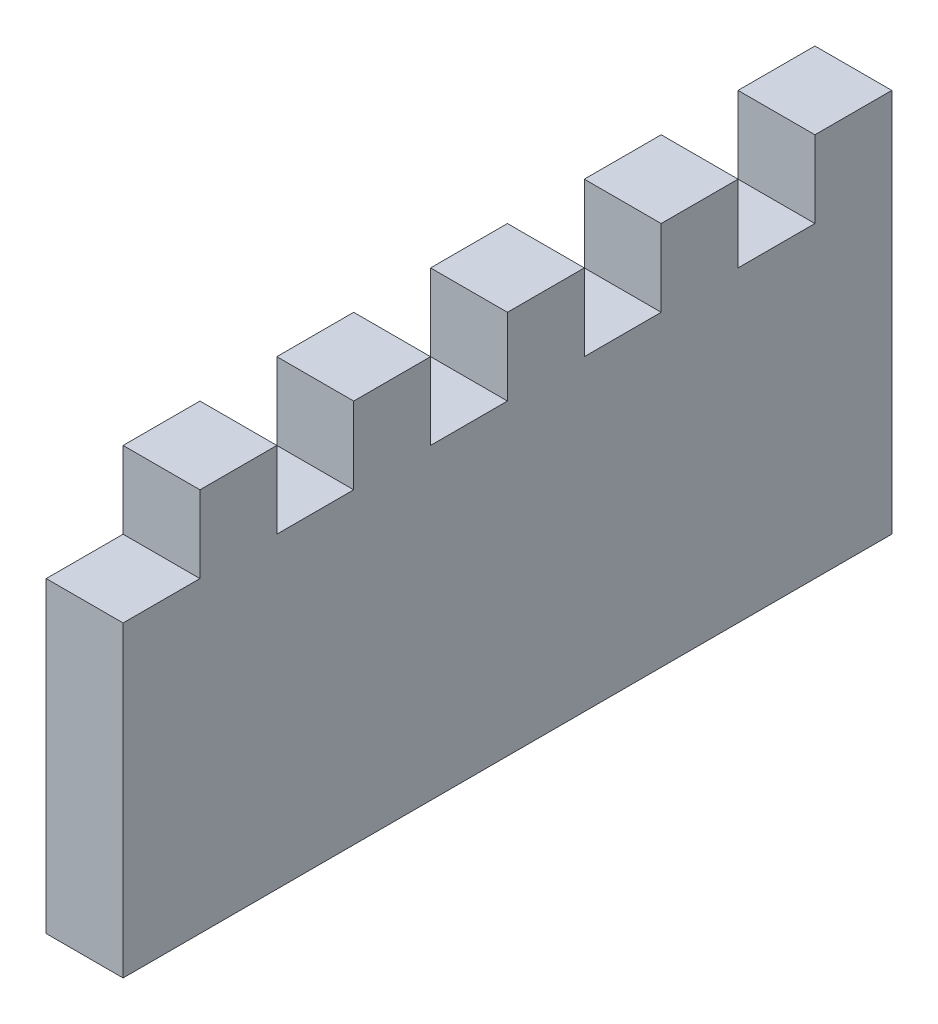
ISO-10303-21;
HEADER;
FILE_DESCRIPTION(('STEP AP214'),'2;1');
FILE_NAME('part.step','',(''),(''),'','','');
FILE_SCHEMA(('AUTOMOTIVE_DESIGN { 1 0 10303 214 1 1 1 1 }'));
ENDSEC;
DATA;
#1=APPLICATION_CONTEXT('core data for automotive mechanical design processes');
#2=APPLICATION_PROTOCOL_DEFINITION('international standard','automotive_design',2000,#1);
#3=PRODUCT_CONTEXT('',#1,'mechanical');
#4=PRODUCT('Part','Part','',(#3));
#5=PRODUCT_RELATED_PRODUCT_CATEGORY('part','',(#4));
#6=PRODUCT_DEFINITION_FORMATION('','',#4);
#7=PRODUCT_DEFINITION_CONTEXT('part definition',#1,'design');
#8=PRODUCT_DEFINITION('design','',#6,#7);
#9=PRODUCT_DEFINITION_SHAPE('','',#8);
#10=(LENGTH_UNIT() NAMED_UNIT(*) SI_UNIT(.MILLI.,.METRE.));
#11=(NAMED_UNIT(*) PLANE_ANGLE_UNIT() SI_UNIT($,.RADIAN.));
#12=(NAMED_UNIT(*) SI_UNIT($,.STERADIAN.) SOLID_ANGLE_UNIT());
#13=UNCERTAINTY_MEASURE_WITH_UNIT(LENGTH_MEASURE(1.E-05),#10,'distance_accuracy_value','');
#14=(GEOMETRIC_REPRESENTATION_CONTEXT(3) GLOBAL_UNCERTAINTY_ASSIGNED_CONTEXT((#13)) GLOBAL_UNIT_ASSIGNED_CONTEXT((#10,
#11,#12)) REPRESENTATION_CONTEXT('',''));
#15=CARTESIAN_POINT('',(0.,0.,0.));
#16=DIRECTION('',(0.,0.,1.));
#17=DIRECTION('',(1.,0.,0.));
#18=AXIS2_PLACEMENT_3D('',#15,#16,#17);
#19=CARTESIAN_POINT('',(10.,50.,0.));
#20=DIRECTION('',(0.,-1.,0.));
#21=DIRECTION('',(0.,0.,-1.));
#22=AXIS2_PLACEMENT_3D('',#19,#20,#21);
#23=PLANE('',#22);
#24=DIRECTION('',(0.,0.,1.));
#25=VECTOR('',#24,1.);
#26=CARTESIAN_POINT('',(0.,50.,0.));
#27=LINE('',#26,#25);
#28=CARTESIAN_POINT('',(0.,50.,60.));
#29=VERTEX_POINT('',#28);
#30=CARTESIAN_POINT('',(0.,50.,70.));
#31=VERTEX_POINT('',#30);
#32=EDGE_CURVE('E203',#29,#31,#27,.T.);
#33=ORIENTED_EDGE('',*,*,#32,.T.);
#34=DIRECTION('',(1.,0.,0.));
#35=VECTOR('',#34,1.);
#36=CARTESIAN_POINT('',(0.,50.,70.));
#37=LINE('',#36,#35);
#38=CARTESIAN_POINT('',(10.,50.,70.));
#39=VERTEX_POINT('',#38);
#40=EDGE_CURVE('E252',#31,#39,#37,.T.);
#41=ORIENTED_EDGE('',*,*,#40,.T.);
#42=DIRECTION('',(0.,0.,1.));
#43=VECTOR('',#42,1.);
#44=CARTESIAN_POINT('',(10.,50.,0.));
#45=LINE('',#44,#43);
#46=CARTESIAN_POINT('',(10.,50.,60.));
#47=VERTEX_POINT('',#46);
#48=EDGE_CURVE('E587',#47,#39,#45,.T.);
#49=ORIENTED_EDGE('',*,*,#48,.F.);
#50=DIRECTION('',(1.,0.,0.));
#51=VECTOR('',#50,1.);
#52=CARTESIAN_POINT('',(0.,50.,60.));
#53=LINE('',#52,#51);
#54=EDGE_CURVE('E266',#29,#47,#53,.T.);
#55=ORIENTED_EDGE('',*,*,#54,.F.);
#56=EDGE_LOOP('',(#33,#41,#49,#55));
#57=FACE_BOUND('',#56,.T.);
#58=ADVANCED_FACE('F33',(#57),#23,.F.);
#59=CARTESIAN_POINT('',(0.,50.,40.));
#60=VERTEX_POINT('',#59);
#61=CARTESIAN_POINT('',(0.,50.,50.));
#62=VERTEX_POINT('',#61);
#63=EDGE_CURVE('E208',#60,#62,#27,.T.);
#64=ORIENTED_EDGE('',*,*,#63,.T.);
#65=DIRECTION('',(1.,0.,0.));
#66=VECTOR('',#65,1.);
#67=CARTESIAN_POINT('',(0.,50.,50.));
#68=LINE('',#67,#66);
#69=CARTESIAN_POINT('',(10.,50.,50.));
#70=VERTEX_POINT('',#69);
#71=EDGE_CURVE('E231',#62,#70,#68,.T.);
#72=ORIENTED_EDGE('',*,*,#71,.T.);
#73=CARTESIAN_POINT('',(10.,50.,40.));
#74=VERTEX_POINT('',#73);
#75=EDGE_CURVE('E594',#74,#70,#45,.T.);
#76=ORIENTED_EDGE('',*,*,#75,.F.);
#77=DIRECTION('',(1.,0.,0.));
#78=VECTOR('',#77,1.);
#79=CARTESIAN_POINT('',(0.,50.,40.));
#80=LINE('',#79,#78);
#81=EDGE_CURVE('E233',#60,#74,#80,.T.);
#82=ORIENTED_EDGE('',*,*,#81,.F.);
#83=EDGE_LOOP('',(#64,#72,#76,#82));
#84=FACE_BOUND('',#83,.T.);
#85=ADVANCED_FACE('F229',(#84),#23,.F.);
#86=CARTESIAN_POINT('',(0.,50.,20.));
#87=VERTEX_POINT('',#86);
#88=CARTESIAN_POINT('',(0.,50.,30.));
#89=VERTEX_POINT('',#88);
#90=EDGE_CURVE('E215',#87,#89,#27,.T.);
#91=ORIENTED_EDGE('',*,*,#90,.T.);
#92=DIRECTION('',(1.,0.,0.));
#93=VECTOR('',#92,1.);
#94=CARTESIAN_POINT('',(0.,50.,30.));
#95=LINE('',#94,#93);
#96=CARTESIAN_POINT('',(10.,50.,30.));
#97=VERTEX_POINT('',#96);
#98=EDGE_CURVE('E276',#89,#97,#95,.T.);
#99=ORIENTED_EDGE('',*,*,#98,.T.);
#100=CARTESIAN_POINT('',(10.,50.,20.));
#101=VERTEX_POINT('',#100);
#102=EDGE_CURVE('E321',#101,#97,#45,.T.);
#103=ORIENTED_EDGE('',*,*,#102,.F.);
#104=DIRECTION('',(1.,0.,0.));
#105=VECTOR('',#104,1.);
#106=CARTESIAN_POINT('',(0.,50.,20.));
#107=LINE('',#106,#105);
#108=EDGE_CURVE('E310',#87,#101,#107,.T.);
#109=ORIENTED_EDGE('',*,*,#108,.F.);
#110=EDGE_LOOP('',(#91,#99,#103,#109));
#111=FACE_BOUND('',#110,.T.);
#112=ADVANCED_FACE('F360',(#111),#23,.F.);
#113=CARTESIAN_POINT('',(0.,50.,0.));
#114=VERTEX_POINT('',#113);
#115=CARTESIAN_POINT('',(0.,50.,10.));
#116=VERTEX_POINT('',#115);
#117=EDGE_CURVE('E206',#114,#116,#27,.T.);
#118=ORIENTED_EDGE('',*,*,#117,.T.);
#119=DIRECTION('',(1.,0.,0.));
#120=VECTOR('',#119,1.);
#121=CARTESIAN_POINT('',(0.,50.,10.));
#122=LINE('',#121,#120);
#123=CARTESIAN_POINT('',(10.,50.,10.));
#124=VERTEX_POINT('',#123);
#125=EDGE_CURVE('E300',#116,#124,#122,.T.);
#126=ORIENTED_EDGE('',*,*,#125,.T.);
#127=CARTESIAN_POINT('',(10.,50.,0.));
#128=VERTEX_POINT('',#127);
#129=EDGE_CURVE('E317',#128,#124,#45,.T.);
#130=ORIENTED_EDGE('',*,*,#129,.F.);
#131=DIRECTION('',(-1.,0.,0.));
#132=VECTOR('',#131,1.);
#133=CARTESIAN_POINT('',(10.,50.,0.));
#134=LINE('',#133,#132);
#135=EDGE_CURVE('E11',#128,#114,#134,.T.);
#136=ORIENTED_EDGE('',*,*,#135,.T.);
#137=EDGE_LOOP('',(#118,#126,#130,#136));
#138=FACE_BOUND('',#137,.T.);
#139=ADVANCED_FACE('F340',(#138),#23,.F.);
#140=CARTESIAN_POINT('',(10.,0.,0.));
#141=DIRECTION('',(0.,0.,1.));
#142=DIRECTION('',(1.,0.,0.));
#143=AXIS2_PLACEMENT_3D('',#140,#141,#142);
#144=PLANE('',#143);
#145=DIRECTION('',(0.,1.,0.));
#146=VECTOR('',#145,1.);
#147=CARTESIAN_POINT('',(0.,0.,0.));
#148=LINE('',#147,#146);
#149=CARTESIAN_POINT('',(0.,0.,0.));
#150=VERTEX_POINT('',#149);
#151=EDGE_CURVE('E204',#150,#114,#148,.T.);
#152=ORIENTED_EDGE('',*,*,#151,.T.);
#153=ORIENTED_EDGE('',*,*,#135,.F.);
#154=DIRECTION('',(0.,1.,0.));
#155=VECTOR('',#154,1.);
#156=CARTESIAN_POINT('',(10.,0.,0.));
#157=LINE('',#156,#155);
#158=CARTESIAN_POINT('',(10.,0.,0.));
#159=VERTEX_POINT('',#158);
#160=EDGE_CURVE('E313',#159,#128,#157,.T.);
#161=ORIENTED_EDGE('',*,*,#160,.F.);
#162=DIRECTION('',(-1.,0.,0.));
#163=VECTOR('',#162,1.);
#164=CARTESIAN_POINT('',(10.,0.,0.));
#165=LINE('',#164,#163);
#166=EDGE_CURVE('E324',#159,#150,#165,.T.);
#167=ORIENTED_EDGE('',*,*,#166,.T.);
#168=EDGE_LOOP('',(#152,#153,#161,#167));
#169=FACE_BOUND('',#168,.T.);
#170=ADVANCED_FACE('F35',(#169),#144,.F.);
#171=CARTESIAN_POINT('',(0.,50.,80.));
#172=VERTEX_POINT('',#171);
#173=CARTESIAN_POINT('',(0.,50.,90.));
#174=VERTEX_POINT('',#173);
#175=EDGE_CURVE('E196',#172,#174,#27,.T.);
#176=ORIENTED_EDGE('',*,*,#175,.T.);
#177=DIRECTION('',(1.,0.,0.));
#178=VECTOR('',#177,1.);
#179=CARTESIAN_POINT('',(0.,50.,90.));
#180=LINE('',#179,#178);
#181=CARTESIAN_POINT('',(10.,50.,90.));
#182=VERTEX_POINT('',#181);
#183=EDGE_CURVE('E180',#174,#182,#180,.T.);
#184=ORIENTED_EDGE('',*,*,#183,.T.);
#185=CARTESIAN_POINT('',(10.,50.,80.));
#186=VERTEX_POINT('',#185);
#187=EDGE_CURVE('E316',#186,#182,#45,.T.);
#188=ORIENTED_EDGE('',*,*,#187,.F.);
#189=DIRECTION('',(1.,0.,0.));
#190=VECTOR('',#189,1.);
#191=CARTESIAN_POINT('',(0.,50.,80.));
#192=LINE('',#191,#190);
#193=EDGE_CURVE('E202',#172,#186,#192,.T.);
#194=ORIENTED_EDGE('',*,*,#193,.F.);
#195=EDGE_LOOP('',(#176,#184,#188,#194));
#196=FACE_BOUND('',#195,.T.);
#197=ADVANCED_FACE('F201',(#196),#23,.F.);
#198=CARTESIAN_POINT('',(10.,0.,100.));
#199=DIRECTION('',(0.,0.,-1.));
#200=DIRECTION('',(-1.,0.,0.));
#201=AXIS2_PLACEMENT_3D('',#198,#199,#200);
#202=PLANE('',#201);
#203=DIRECTION('',(0.,-1.,0.));
#204=VECTOR('',#203,1.);
#205=CARTESIAN_POINT('',(10.,0.,100.));
#206=LINE('',#205,#204);
#207=CARTESIAN_POINT('',(10.,40.,100.));
#208=VERTEX_POINT('',#207);
#209=CARTESIAN_POINT('',(10.,0.,100.));
#210=VERTEX_POINT('',#209);
#211=EDGE_CURVE('E320',#208,#210,#206,.T.);
#212=ORIENTED_EDGE('',*,*,#211,.F.);
#213=DIRECTION('',(1.,0.,0.));
#214=VECTOR('',#213,1.);
#215=CARTESIAN_POINT('',(0.,40.,100.));
#216=LINE('',#215,#214);
#217=CARTESIAN_POINT('',(0.,40.,100.));
#218=VERTEX_POINT('',#217);
#219=EDGE_CURVE('E188',#218,#208,#216,.T.);
#220=ORIENTED_EDGE('',*,*,#219,.F.);
#221=DIRECTION('',(0.,-1.,0.));
#222=VECTOR('',#221,1.);
#223=CARTESIAN_POINT('',(0.,0.,100.));
#224=LINE('',#223,#222);
#225=CARTESIAN_POINT('',(0.,0.,100.));
#226=VERTEX_POINT('',#225);
#227=EDGE_CURVE('E214',#218,#226,#224,.T.);
#228=ORIENTED_EDGE('',*,*,#227,.T.);
#229=DIRECTION('',(-1.,0.,0.));
#230=VECTOR('',#229,1.);
#231=CARTESIAN_POINT('',(10.,0.,100.));
#232=LINE('',#231,#230);
#233=EDGE_CURVE('E41',#210,#226,#232,.T.);
#234=ORIENTED_EDGE('',*,*,#233,.F.);
#235=EDGE_LOOP('',(#212,#220,#228,#234));
#236=FACE_BOUND('',#235,.T.);
#237=ADVANCED_FACE('F352',(#236),#202,.F.);
#238=CARTESIAN_POINT('',(10.,0.,0.));
#239=DIRECTION('',(0.,1.,0.));
#240=DIRECTION('',(0.,0.,1.));
#241=AXIS2_PLACEMENT_3D('',#238,#239,#240);
#242=PLANE('',#241);
#243=DIRECTION('',(0.,0.,-1.));
#244=VECTOR('',#243,1.);
#245=CARTESIAN_POINT('',(0.,0.,0.));
#246=LINE('',#245,#244);
#247=EDGE_CURVE('E218',#226,#150,#246,.T.);
#248=ORIENTED_EDGE('',*,*,#247,.T.);
#249=ORIENTED_EDGE('',*,*,#166,.F.);
#250=DIRECTION('',(0.,0.,-1.));
#251=VECTOR('',#250,1.);
#252=CARTESIAN_POINT('',(10.,0.,0.));
#253=LINE('',#252,#251);
#254=EDGE_CURVE('E323',#210,#159,#253,.T.);
#255=ORIENTED_EDGE('',*,*,#254,.F.);
#256=ORIENTED_EDGE('',*,*,#233,.T.);
#257=EDGE_LOOP('',(#248,#249,#255,#256));
#258=FACE_BOUND('',#257,.T.);
#259=ADVANCED_FACE('F337',(#258),#242,.F.);
#260=CARTESIAN_POINT('',(10.,0.,0.));
#261=DIRECTION('',(1.,0.,0.));
#262=DIRECTION('',(0.,0.,-1.));
#263=AXIS2_PLACEMENT_3D('',#260,#261,#262);
#264=PLANE('',#263);
#265=DIRECTION('',(0.,1.,0.));
#266=VECTOR('',#265,1.);
#267=CARTESIAN_POINT('',(10.,50.,90.));
#268=LINE('',#267,#266);
#269=CARTESIAN_POINT('',(10.,40.,90.));
#270=VERTEX_POINT('',#269);
#271=EDGE_CURVE('E183',#270,#182,#268,.T.);
#272=ORIENTED_EDGE('',*,*,#271,.F.);
#273=DIRECTION('',(0.,0.,-1.));
#274=VECTOR('',#273,1.);
#275=CARTESIAN_POINT('',(10.,40.,90.));
#276=LINE('',#275,#274);
#277=EDGE_CURVE('E198',#208,#270,#276,.T.);
#278=ORIENTED_EDGE('',*,*,#277,.F.);
#279=ORIENTED_EDGE('',*,*,#211,.T.);
#280=ORIENTED_EDGE('',*,*,#254,.T.);
#281=ORIENTED_EDGE('',*,*,#160,.T.);
#282=ORIENTED_EDGE('',*,*,#129,.T.);
#283=DIRECTION('',(0.,1.,0.));
#284=VECTOR('',#283,1.);
#285=CARTESIAN_POINT('',(10.,50.,10.));
#286=LINE('',#285,#284);
#287=CARTESIAN_POINT('',(10.,40.,10.));
#288=VERTEX_POINT('',#287);
#289=EDGE_CURVE('E285',#288,#124,#286,.T.);
#290=ORIENTED_EDGE('',*,*,#289,.F.);
#291=DIRECTION('',(0.,0.,-1.));
#292=VECTOR('',#291,1.);
#293=CARTESIAN_POINT('',(10.,40.,10.));
#294=LINE('',#293,#292);
#295=CARTESIAN_POINT('',(10.,40.,20.));
#296=VERTEX_POINT('',#295);
#297=EDGE_CURVE('E294',#296,#288,#294,.T.);
#298=ORIENTED_EDGE('',*,*,#297,.F.);
#299=DIRECTION('',(0.,-1.,0.));
#300=VECTOR('',#299,1.);
#301=CARTESIAN_POINT('',(10.,50.,20.));
#302=LINE('',#301,#300);
#303=EDGE_CURVE('E302',#101,#296,#302,.T.);
#304=ORIENTED_EDGE('',*,*,#303,.F.);
#305=ORIENTED_EDGE('',*,*,#102,.T.);
#306=DIRECTION('',(0.,1.,0.));
#307=VECTOR('',#306,1.);
#308=CARTESIAN_POINT('',(10.,50.,30.));
#309=LINE('',#308,#307);
#310=CARTESIAN_POINT('',(10.,40.,30.));
#311=VERTEX_POINT('',#310);
#312=EDGE_CURVE('E263',#311,#97,#309,.T.);
#313=ORIENTED_EDGE('',*,*,#312,.F.);
#314=DIRECTION('',(0.,0.,-1.));
#315=VECTOR('',#314,1.);
#316=CARTESIAN_POINT('',(10.,40.,30.));
#317=LINE('',#316,#315);
#318=CARTESIAN_POINT('',(10.,40.,40.));
#319=VERTEX_POINT('',#318);
#320=EDGE_CURVE('E272',#319,#311,#317,.T.);
#321=ORIENTED_EDGE('',*,*,#320,.F.);
#322=DIRECTION('',(0.,-1.,0.));
#323=VECTOR('',#322,1.);
#324=CARTESIAN_POINT('',(10.,50.,40.));
#325=LINE('',#324,#323);
#326=EDGE_CURVE('E278',#74,#319,#325,.T.);
#327=ORIENTED_EDGE('',*,*,#326,.F.);
#328=ORIENTED_EDGE('',*,*,#75,.T.);
#329=DIRECTION('',(0.,1.,0.));
#330=VECTOR('',#329,1.);
#331=CARTESIAN_POINT('',(10.,50.,50.));
#332=LINE('',#331,#330);
#333=CARTESIAN_POINT('',(10.,40.,50.));
#334=VERTEX_POINT('',#333);
#335=EDGE_CURVE('E256',#334,#70,#332,.T.);
#336=ORIENTED_EDGE('',*,*,#335,.F.);
#337=DIRECTION('',(0.,0.,-1.));
#338=VECTOR('',#337,1.);
#339=CARTESIAN_POINT('',(10.,40.,50.));
#340=LINE('',#339,#338);
#341=CARTESIAN_POINT('',(10.,40.,60.));
#342=VERTEX_POINT('',#341);
#343=EDGE_CURVE('E245',#342,#334,#340,.T.);
#344=ORIENTED_EDGE('',*,*,#343,.F.);
#345=DIRECTION('',(0.,-1.,0.));
#346=VECTOR('',#345,1.);
#347=CARTESIAN_POINT('',(10.,50.,60.));
#348=LINE('',#347,#346);
#349=EDGE_CURVE('E249',#47,#342,#348,.T.);
#350=ORIENTED_EDGE('',*,*,#349,.F.);
#351=ORIENTED_EDGE('',*,*,#48,.T.);
#352=DIRECTION('',(0.,1.,0.));
#353=VECTOR('',#352,1.);
#354=CARTESIAN_POINT('',(10.,50.,70.));
#355=LINE('',#354,#353);
#356=CARTESIAN_POINT('',(10.,40.,70.));
#357=VERTEX_POINT('',#356);
#358=EDGE_CURVE('E565',#357,#39,#355,.T.);
#359=ORIENTED_EDGE('',*,*,#358,.F.);
#360=DIRECTION('',(0.,0.,-1.));
#361=VECTOR('',#360,1.);
#362=CARTESIAN_POINT('',(10.,40.,70.));
#363=LINE('',#362,#361);
#364=CARTESIAN_POINT('',(10.,40.,80.));
#365=VERTEX_POINT('',#364);
#366=EDGE_CURVE('E571',#365,#357,#363,.T.);
#367=ORIENTED_EDGE('',*,*,#366,.F.);
#368=DIRECTION('',(0.,-1.,0.));
#369=VECTOR('',#368,1.);
#370=CARTESIAN_POINT('',(10.,50.,80.));
#371=LINE('',#370,#369);
#372=EDGE_CURVE('E575',#186,#365,#371,.T.);
#373=ORIENTED_EDGE('',*,*,#372,.F.);
#374=ORIENTED_EDGE('',*,*,#187,.T.);
#375=EDGE_LOOP('',(#272,#278,#279,#280,#281,#282,#290,#298,#304,#305,#313,#321,#327,#328,#336,
#344,#350,#351,#359,#367,#373,#374));
#376=FACE_BOUND('',#375,.T.);
#377=ADVANCED_FACE('F342',(#376),#264,.T.);
#378=CARTESIAN_POINT('',(0.,0.,0.));
#379=DIRECTION('',(1.,0.,0.));
#380=DIRECTION('',(0.,0.,-1.));
#381=AXIS2_PLACEMENT_3D('',#378,#379,#380);
#382=PLANE('',#381);
#383=DIRECTION('',(0.,0.,-1.));
#384=VECTOR('',#383,1.);
#385=CARTESIAN_POINT('',(0.,40.,90.));
#386=LINE('',#385,#384);
#387=CARTESIAN_POINT('',(0.,40.,90.));
#388=VERTEX_POINT('',#387);
#389=EDGE_CURVE('E189',#218,#388,#386,.T.);
#390=ORIENTED_EDGE('',*,*,#389,.T.);
#391=DIRECTION('',(0.,1.,0.));
#392=VECTOR('',#391,1.);
#393=CARTESIAN_POINT('',(0.,50.,90.));
#394=LINE('',#393,#392);
#395=EDGE_CURVE('E48',#388,#174,#394,.T.);
#396=ORIENTED_EDGE('',*,*,#395,.T.);
#397=ORIENTED_EDGE('',*,*,#175,.F.);
#398=DIRECTION('',(0.,-1.,0.));
#399=VECTOR('',#398,1.);
#400=CARTESIAN_POINT('',(0.,50.,80.));
#401=LINE('',#400,#399);
#402=CARTESIAN_POINT('',(0.,40.,80.));
#403=VERTEX_POINT('',#402);
#404=EDGE_CURVE('E570',#172,#403,#401,.T.);
#405=ORIENTED_EDGE('',*,*,#404,.T.);
#406=DIRECTION('',(0.,0.,-1.));
#407=VECTOR('',#406,1.);
#408=CARTESIAN_POINT('',(0.,40.,70.));
#409=LINE('',#408,#407);
#410=CARTESIAN_POINT('',(0.,40.,70.));
#411=VERTEX_POINT('',#410);
#412=EDGE_CURVE('E56',#403,#411,#409,.T.);
#413=ORIENTED_EDGE('',*,*,#412,.T.);
#414=DIRECTION('',(0.,1.,0.));
#415=VECTOR('',#414,1.);
#416=CARTESIAN_POINT('',(0.,50.,70.));
#417=LINE('',#416,#415);
#418=EDGE_CURVE('E567',#411,#31,#417,.T.);
#419=ORIENTED_EDGE('',*,*,#418,.T.);
#420=ORIENTED_EDGE('',*,*,#32,.F.);
#421=DIRECTION('',(0.,-1.,0.));
#422=VECTOR('',#421,1.);
#423=CARTESIAN_POINT('',(0.,50.,60.));
#424=LINE('',#423,#422);
#425=CARTESIAN_POINT('',(0.,40.,60.));
#426=VERTEX_POINT('',#425);
#427=EDGE_CURVE('E244',#29,#426,#424,.T.);
#428=ORIENTED_EDGE('',*,*,#427,.T.);
#429=DIRECTION('',(0.,0.,-1.));
#430=VECTOR('',#429,1.);
#431=CARTESIAN_POINT('',(0.,40.,50.));
#432=LINE('',#431,#430);
#433=CARTESIAN_POINT('',(0.,40.,50.));
#434=VERTEX_POINT('',#433);
#435=EDGE_CURVE('E242',#426,#434,#432,.T.);
#436=ORIENTED_EDGE('',*,*,#435,.T.);
#437=DIRECTION('',(0.,1.,0.));
#438=VECTOR('',#437,1.);
#439=CARTESIAN_POINT('',(0.,50.,50.));
#440=LINE('',#439,#438);
#441=EDGE_CURVE('E240',#434,#62,#440,.T.);
#442=ORIENTED_EDGE('',*,*,#441,.T.);
#443=ORIENTED_EDGE('',*,*,#63,.F.);
#444=DIRECTION('',(0.,-1.,0.));
#445=VECTOR('',#444,1.);
#446=CARTESIAN_POINT('',(0.,50.,40.));
#447=LINE('',#446,#445);
#448=CARTESIAN_POINT('',(0.,40.,40.));
#449=VERTEX_POINT('',#448);
#450=EDGE_CURVE('E237',#60,#449,#447,.T.);
#451=ORIENTED_EDGE('',*,*,#450,.T.);
#452=DIRECTION('',(0.,0.,-1.));
#453=VECTOR('',#452,1.);
#454=CARTESIAN_POINT('',(0.,40.,30.));
#455=LINE('',#454,#453);
#456=CARTESIAN_POINT('',(0.,40.,30.));
#457=VERTEX_POINT('',#456);
#458=EDGE_CURVE('E274',#449,#457,#455,.T.);
#459=ORIENTED_EDGE('',*,*,#458,.T.);
#460=DIRECTION('',(0.,1.,0.));
#461=VECTOR('',#460,1.);
#462=CARTESIAN_POINT('',(0.,50.,30.));
#463=LINE('',#462,#461);
#464=EDGE_CURVE('E269',#457,#89,#463,.T.);
#465=ORIENTED_EDGE('',*,*,#464,.T.);
#466=ORIENTED_EDGE('',*,*,#90,.F.);
#467=DIRECTION('',(0.,-1.,0.));
#468=VECTOR('',#467,1.);
#469=CARTESIAN_POINT('',(0.,50.,20.));
#470=LINE('',#469,#468);
#471=CARTESIAN_POINT('',(0.,40.,20.));
#472=VERTEX_POINT('',#471);
#473=EDGE_CURVE('E293',#87,#472,#470,.T.);
#474=ORIENTED_EDGE('',*,*,#473,.T.);
#475=DIRECTION('',(0.,0.,-1.));
#476=VECTOR('',#475,1.);
#477=CARTESIAN_POINT('',(0.,40.,10.));
#478=LINE('',#477,#476);
#479=CARTESIAN_POINT('',(0.,40.,10.));
#480=VERTEX_POINT('',#479);
#481=EDGE_CURVE('E297',#472,#480,#478,.T.);
#482=ORIENTED_EDGE('',*,*,#481,.T.);
#483=DIRECTION('',(0.,1.,0.));
#484=VECTOR('',#483,1.);
#485=CARTESIAN_POINT('',(0.,50.,10.));
#486=LINE('',#485,#484);
#487=EDGE_CURVE('E290',#480,#116,#486,.T.);
#488=ORIENTED_EDGE('',*,*,#487,.T.);
#489=ORIENTED_EDGE('',*,*,#117,.F.);
#490=ORIENTED_EDGE('',*,*,#151,.F.);
#491=ORIENTED_EDGE('',*,*,#247,.F.);
#492=ORIENTED_EDGE('',*,*,#227,.F.);
#493=EDGE_LOOP('',(#390,#396,#397,#405,#413,#419,#420,#428,#436,#442,#443,#451,#459,#465,#466,
#474,#482,#488,#489,#490,#491,#492));
#494=FACE_BOUND('',#493,.T.);
#495=ADVANCED_FACE('F194',(#494),#382,.F.);
#496=CARTESIAN_POINT('',(0.,50.,10.));
#497=DIRECTION('',(0.,0.,-1.));
#498=DIRECTION('',(0.,1.,0.));
#499=AXIS2_PLACEMENT_3D('',#496,#497,#498);
#500=PLANE('',#499);
#501=ORIENTED_EDGE('',*,*,#289,.T.);
#502=ORIENTED_EDGE('',*,*,#125,.F.);
#503=ORIENTED_EDGE('',*,*,#487,.F.);
#504=DIRECTION('',(1.,0.,0.));
#505=VECTOR('',#504,1.);
#506=CARTESIAN_POINT('',(0.,40.,10.));
#507=LINE('',#506,#505);
#508=EDGE_CURVE('E210',#480,#288,#507,.T.);
#509=ORIENTED_EDGE('',*,*,#508,.T.);
#510=EDGE_LOOP('',(#501,#502,#503,#509));
#511=FACE_BOUND('',#510,.T.);
#512=ADVANCED_FACE('F350',(#511),#500,.F.);
#513=CARTESIAN_POINT('',(0.,40.,10.));
#514=DIRECTION('',(0.,-1.,0.));
#515=DIRECTION('',(0.,0.,-1.));
#516=AXIS2_PLACEMENT_3D('',#513,#514,#515);
#517=PLANE('',#516);
#518=ORIENTED_EDGE('',*,*,#297,.T.);
#519=ORIENTED_EDGE('',*,*,#508,.F.);
#520=ORIENTED_EDGE('',*,*,#481,.F.);
#521=DIRECTION('',(1.,0.,0.));
#522=VECTOR('',#521,1.);
#523=CARTESIAN_POINT('',(0.,40.,20.));
#524=LINE('',#523,#522);
#525=EDGE_CURVE('E308',#472,#296,#524,.T.);
#526=ORIENTED_EDGE('',*,*,#525,.T.);
#527=EDGE_LOOP('',(#518,#519,#520,#526));
#528=FACE_BOUND('',#527,.T.);
#529=ADVANCED_FACE('F394',(#528),#517,.F.);
#530=CARTESIAN_POINT('',(0.,50.,20.));
#531=DIRECTION('',(0.,0.,1.));
#532=DIRECTION('',(1.,0.,0.));
#533=AXIS2_PLACEMENT_3D('',#530,#531,#532);
#534=PLANE('',#533);
#535=ORIENTED_EDGE('',*,*,#303,.T.);
#536=ORIENTED_EDGE('',*,*,#525,.F.);
#537=ORIENTED_EDGE('',*,*,#473,.F.);
#538=ORIENTED_EDGE('',*,*,#108,.T.);
#539=EDGE_LOOP('',(#535,#536,#537,#538));
#540=FACE_BOUND('',#539,.T.);
#541=ADVANCED_FACE('F388',(#540),#534,.F.);
#542=CARTESIAN_POINT('',(0.,50.,30.));
#543=DIRECTION('',(0.,0.,-1.));
#544=DIRECTION('',(0.,1.,0.));
#545=AXIS2_PLACEMENT_3D('',#542,#543,#544);
#546=PLANE('',#545);
#547=ORIENTED_EDGE('',*,*,#312,.T.);
#548=ORIENTED_EDGE('',*,*,#98,.F.);
#549=ORIENTED_EDGE('',*,*,#464,.F.);
#550=DIRECTION('',(1.,0.,0.));
#551=VECTOR('',#550,1.);
#552=CARTESIAN_POINT('',(0.,40.,30.));
#553=LINE('',#552,#551);
#554=EDGE_CURVE('E283',#457,#311,#553,.T.);
#555=ORIENTED_EDGE('',*,*,#554,.T.);
#556=EDGE_LOOP('',(#547,#548,#549,#555));
#557=FACE_BOUND('',#556,.T.);
#558=ADVANCED_FACE('F393',(#557),#546,.F.);
#559=CARTESIAN_POINT('',(0.,40.,30.));
#560=DIRECTION('',(0.,-1.,0.));
#561=DIRECTION('',(0.,0.,-1.));
#562=AXIS2_PLACEMENT_3D('',#559,#560,#561);
#563=PLANE('',#562);
#564=ORIENTED_EDGE('',*,*,#320,.T.);
#565=ORIENTED_EDGE('',*,*,#554,.F.);
#566=ORIENTED_EDGE('',*,*,#458,.F.);
#567=DIRECTION('',(1.,0.,0.));
#568=VECTOR('',#567,1.);
#569=CARTESIAN_POINT('',(0.,40.,40.));
#570=LINE('',#569,#568);
#571=EDGE_CURVE('E286',#449,#319,#570,.T.);
#572=ORIENTED_EDGE('',*,*,#571,.T.);
#573=EDGE_LOOP('',(#564,#565,#566,#572));
#574=FACE_BOUND('',#573,.T.);
#575=ADVANCED_FACE('F456',(#574),#563,.F.);
#576=CARTESIAN_POINT('',(0.,50.,40.));
#577=DIRECTION('',(0.,0.,1.));
#578=DIRECTION('',(1.,0.,0.));
#579=AXIS2_PLACEMENT_3D('',#576,#577,#578);
#580=PLANE('',#579);
#581=ORIENTED_EDGE('',*,*,#326,.T.);
#582=ORIENTED_EDGE('',*,*,#571,.F.);
#583=ORIENTED_EDGE('',*,*,#450,.F.);
#584=ORIENTED_EDGE('',*,*,#81,.T.);
#585=EDGE_LOOP('',(#581,#582,#583,#584));
#586=FACE_BOUND('',#585,.T.);
#587=ADVANCED_FACE('F466',(#586),#580,.F.);
#588=CARTESIAN_POINT('',(0.,50.,50.));
#589=DIRECTION('',(0.,0.,-1.));
#590=DIRECTION('',(0.,1.,0.));
#591=AXIS2_PLACEMENT_3D('',#588,#589,#590);
#592=PLANE('',#591);
#593=ORIENTED_EDGE('',*,*,#335,.T.);
#594=ORIENTED_EDGE('',*,*,#71,.F.);
#595=ORIENTED_EDGE('',*,*,#441,.F.);
#596=DIRECTION('',(1.,0.,0.));
#597=VECTOR('',#596,1.);
#598=CARTESIAN_POINT('',(0.,40.,50.));
#599=LINE('',#598,#597);
#600=EDGE_CURVE('E261',#434,#334,#599,.T.);
#601=ORIENTED_EDGE('',*,*,#600,.T.);
#602=EDGE_LOOP('',(#593,#594,#595,#601));
#603=FACE_BOUND('',#602,.T.);
#604=ADVANCED_FACE('F476',(#603),#592,.F.);
#605=CARTESIAN_POINT('',(0.,40.,50.));
#606=DIRECTION('',(0.,-1.,0.));
#607=DIRECTION('',(0.,0.,-1.));
#608=AXIS2_PLACEMENT_3D('',#605,#606,#607);
#609=PLANE('',#608);
#610=ORIENTED_EDGE('',*,*,#343,.T.);
#611=ORIENTED_EDGE('',*,*,#600,.F.);
#612=ORIENTED_EDGE('',*,*,#435,.F.);
#613=DIRECTION('',(1.,0.,0.));
#614=VECTOR('',#613,1.);
#615=CARTESIAN_POINT('',(0.,40.,60.));
#616=LINE('',#615,#614);
#617=EDGE_CURVE('E264',#426,#342,#616,.T.);
#618=ORIENTED_EDGE('',*,*,#617,.T.);
#619=EDGE_LOOP('',(#610,#611,#612,#618));
#620=FACE_BOUND('',#619,.T.);
#621=ADVANCED_FACE('F486',(#620),#609,.F.);
#622=CARTESIAN_POINT('',(0.,50.,60.));
#623=DIRECTION('',(0.,0.,1.));
#624=DIRECTION('',(1.,0.,0.));
#625=AXIS2_PLACEMENT_3D('',#622,#623,#624);
#626=PLANE('',#625);
#627=ORIENTED_EDGE('',*,*,#349,.T.);
#628=ORIENTED_EDGE('',*,*,#617,.F.);
#629=ORIENTED_EDGE('',*,*,#427,.F.);
#630=ORIENTED_EDGE('',*,*,#54,.T.);
#631=EDGE_LOOP('',(#627,#628,#629,#630));
#632=FACE_BOUND('',#631,.T.);
#633=ADVANCED_FACE('F495',(#632),#626,.F.);
#634=CARTESIAN_POINT('',(0.,50.,70.));
#635=DIRECTION('',(0.,0.,-1.));
#636=DIRECTION('',(0.,1.,0.));
#637=AXIS2_PLACEMENT_3D('',#634,#635,#636);
#638=PLANE('',#637);
#639=ORIENTED_EDGE('',*,*,#358,.T.);
#640=ORIENTED_EDGE('',*,*,#40,.F.);
#641=ORIENTED_EDGE('',*,*,#418,.F.);
#642=DIRECTION('',(1.,0.,0.));
#643=VECTOR('',#642,1.);
#644=CARTESIAN_POINT('',(0.,40.,70.));
#645=LINE('',#644,#643);
#646=EDGE_CURVE('E258',#411,#357,#645,.T.);
#647=ORIENTED_EDGE('',*,*,#646,.T.);
#648=EDGE_LOOP('',(#639,#640,#641,#647));
#649=FACE_BOUND('',#648,.T.);
#650=ADVANCED_FACE('F505',(#649),#638,.F.);
#651=CARTESIAN_POINT('',(0.,40.,70.));
#652=DIRECTION('',(0.,-1.,0.));
#653=DIRECTION('',(0.,0.,-1.));
#654=AXIS2_PLACEMENT_3D('',#651,#652,#653);
#655=PLANE('',#654);
#656=ORIENTED_EDGE('',*,*,#366,.T.);
#657=ORIENTED_EDGE('',*,*,#646,.F.);
#658=ORIENTED_EDGE('',*,*,#412,.F.);
#659=DIRECTION('',(1.,0.,0.));
#660=VECTOR('',#659,1.);
#661=CARTESIAN_POINT('',(0.,40.,80.));
#662=LINE('',#661,#660);
#663=EDGE_CURVE('E581',#403,#365,#662,.T.);
#664=ORIENTED_EDGE('',*,*,#663,.T.);
#665=EDGE_LOOP('',(#656,#657,#658,#664));
#666=FACE_BOUND('',#665,.T.);
#667=ADVANCED_FACE('F515',(#666),#655,.F.);
#668=CARTESIAN_POINT('',(0.,50.,80.));
#669=DIRECTION('',(0.,0.,1.));
#670=DIRECTION('',(1.,0.,0.));
#671=AXIS2_PLACEMENT_3D('',#668,#669,#670);
#672=PLANE('',#671);
#673=ORIENTED_EDGE('',*,*,#372,.T.);
#674=ORIENTED_EDGE('',*,*,#663,.F.);
#675=ORIENTED_EDGE('',*,*,#404,.F.);
#676=ORIENTED_EDGE('',*,*,#193,.T.);
#677=EDGE_LOOP('',(#673,#674,#675,#676));
#678=FACE_BOUND('',#677,.T.);
#679=ADVANCED_FACE('F525',(#678),#672,.F.);
#680=CARTESIAN_POINT('',(0.,50.,90.));
#681=DIRECTION('',(0.,0.,-1.));
#682=DIRECTION('',(0.,1.,0.));
#683=AXIS2_PLACEMENT_3D('',#680,#681,#682);
#684=PLANE('',#683);
#685=ORIENTED_EDGE('',*,*,#271,.T.);
#686=ORIENTED_EDGE('',*,*,#183,.F.);
#687=ORIENTED_EDGE('',*,*,#395,.F.);
#688=DIRECTION('',(1.,0.,0.));
#689=VECTOR('',#688,1.);
#690=CARTESIAN_POINT('',(0.,40.,90.));
#691=LINE('',#690,#689);
#692=EDGE_CURVE('E557',#388,#270,#691,.T.);
#693=ORIENTED_EDGE('',*,*,#692,.T.);
#694=EDGE_LOOP('',(#685,#686,#687,#693));
#695=FACE_BOUND('',#694,.T.);
#696=ADVANCED_FACE('F181',(#695),#684,.F.);
#697=CARTESIAN_POINT('',(0.,40.,90.));
#698=DIRECTION('',(0.,-1.,0.));
#699=DIRECTION('',(0.,0.,-1.));
#700=AXIS2_PLACEMENT_3D('',#697,#698,#699);
#701=PLANE('',#700);
#702=ORIENTED_EDGE('',*,*,#277,.T.);
#703=ORIENTED_EDGE('',*,*,#692,.F.);
#704=ORIENTED_EDGE('',*,*,#389,.F.);
#705=ORIENTED_EDGE('',*,*,#219,.T.);
#706=EDGE_LOOP('',(#702,#703,#704,#705));
#707=FACE_BOUND('',#706,.T.);
#708=ADVANCED_FACE('F543',(#707),#701,.F.);
#709=CLOSED_SHELL('',(#58,#85,#112,#139,#170,#197,#237,#259,#377,#495,#512,#529,#541,#558,#575,
#587,#604,#621,#633,#650,#667,#679,#696,#708));
#710=MANIFOLD_SOLID_BREP('B2',#709);
#711=ADVANCED_BREP_SHAPE_REPRESENTATION('',(#18,#710),#14);
#712=SHAPE_DEFINITION_REPRESENTATION(#9,#711);
ENDSEC;
END-ISO-10303-21;
